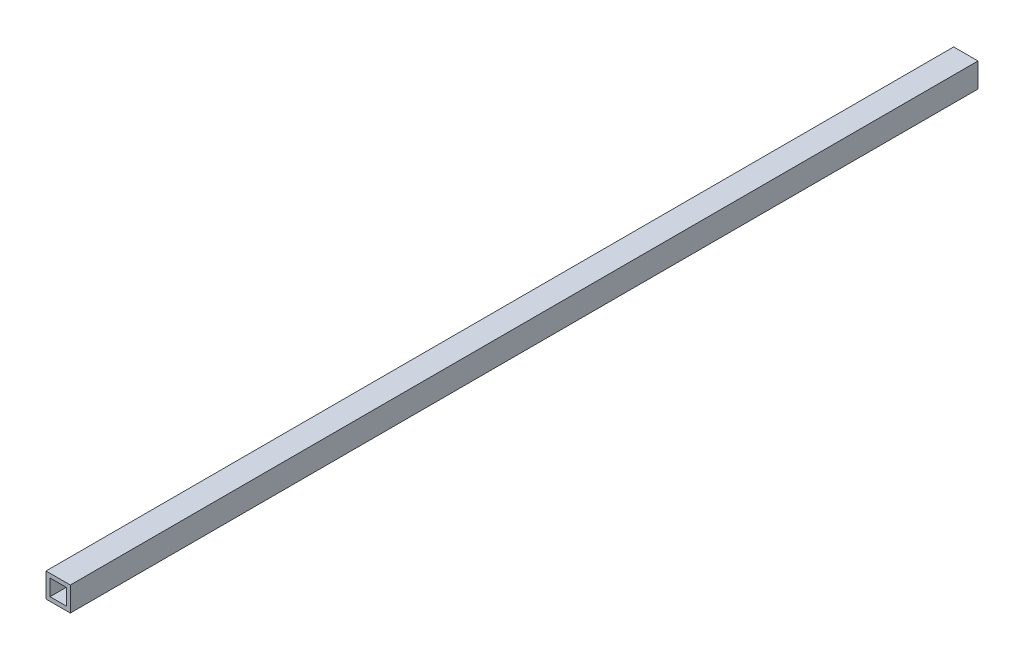
ISO-10303-21;
HEADER;
FILE_DESCRIPTION(('STEP AP214'),'2;1');
FILE_NAME('part.step','',(''),(''),'','','');
FILE_SCHEMA(('AUTOMOTIVE_DESIGN { 1 0 10303 214 1 1 1 1 }'));
ENDSEC;
DATA;
#1=APPLICATION_CONTEXT('core data for automotive mechanical design processes');
#2=APPLICATION_PROTOCOL_DEFINITION('international standard','automotive_design',2000,#1);
#3=PRODUCT_CONTEXT('',#1,'mechanical');
#4=PRODUCT('Part','Part','',(#3));
#5=PRODUCT_RELATED_PRODUCT_CATEGORY('part','',(#4));
#6=PRODUCT_DEFINITION_FORMATION('','',#4);
#7=PRODUCT_DEFINITION_CONTEXT('part definition',#1,'design');
#8=PRODUCT_DEFINITION('design','',#6,#7);
#9=PRODUCT_DEFINITION_SHAPE('','',#8);
#10=(LENGTH_UNIT() NAMED_UNIT(*) SI_UNIT(.MILLI.,.METRE.));
#11=(NAMED_UNIT(*) PLANE_ANGLE_UNIT() SI_UNIT($,.RADIAN.));
#12=(NAMED_UNIT(*) SI_UNIT($,.STERADIAN.) SOLID_ANGLE_UNIT());
#13=UNCERTAINTY_MEASURE_WITH_UNIT(LENGTH_MEASURE(1.E-05),#10,'distance_accuracy_value','');
#14=(GEOMETRIC_REPRESENTATION_CONTEXT(3) GLOBAL_UNCERTAINTY_ASSIGNED_CONTEXT((#13)) GLOBAL_UNIT_ASSIGNED_CONTEXT((#10,
#11,#12)) REPRESENTATION_CONTEXT('',''));
#15=CARTESIAN_POINT('',(0.,0.,0.));
#16=DIRECTION('',(0.,0.,1.));
#17=DIRECTION('',(1.,0.,0.));
#18=AXIS2_PLACEMENT_3D('',#15,#16,#17);
#19=CARTESIAN_POINT('',(9.52500000000001,-9.52499999999999,-711.2));
#20=DIRECTION('',(1.,0.,0.));
#21=DIRECTION('',(0.,0.,-1.));
#22=AXIS2_PLACEMENT_3D('',#19,#20,#21);
#23=PLANE('',#22);
#24=DIRECTION('',(0.,1.,0.));
#25=VECTOR('',#24,1.);
#26=CARTESIAN_POINT('',(9.52500000000001,-9.52499999999999,0.));
#27=LINE('',#26,#25);
#28=CARTESIAN_POINT('',(9.52500000000001,-9.52499999999999,0.));
#29=VERTEX_POINT('',#28);
#30=CARTESIAN_POINT('',(9.52500000000001,9.52500000000001,0.));
#31=VERTEX_POINT('',#30);
#32=EDGE_CURVE('E112',#29,#31,#27,.T.);
#33=ORIENTED_EDGE('',*,*,#32,.F.);
#34=DIRECTION('',(0.,0.,1.));
#35=VECTOR('',#34,1.);
#36=CARTESIAN_POINT('',(9.52500000000001,-9.52499999999999,-711.2));
#37=LINE('',#36,#35);
#38=CARTESIAN_POINT('',(9.52500000000001,-9.52499999999999,-711.2));
#39=VERTEX_POINT('',#38);
#40=EDGE_CURVE('E11',#39,#29,#37,.T.);
#41=ORIENTED_EDGE('',*,*,#40,.F.);
#42=DIRECTION('',(0.,1.,0.));
#43=VECTOR('',#42,1.);
#44=CARTESIAN_POINT('',(9.52500000000001,-9.52499999999999,-711.2));
#45=LINE('',#44,#43);
#46=CARTESIAN_POINT('',(9.52500000000001,9.52500000000001,-711.2));
#47=VERTEX_POINT('',#46);
#48=EDGE_CURVE('E151',#39,#47,#45,.T.);
#49=ORIENTED_EDGE('',*,*,#48,.T.);
#50=DIRECTION('',(0.,0.,1.));
#51=VECTOR('',#50,1.);
#52=CARTESIAN_POINT('',(9.52500000000001,9.52500000000001,-711.2));
#53=LINE('',#52,#51);
#54=EDGE_CURVE('E42',#47,#31,#53,.T.);
#55=ORIENTED_EDGE('',*,*,#54,.T.);
#56=EDGE_LOOP('',(#33,#41,#49,#55));
#57=FACE_BOUND('',#56,.T.);
#58=ADVANCED_FACE('F39',(#57),#23,.T.);
#59=CARTESIAN_POINT('',(-9.525,-9.52499999999999,-711.2));
#60=DIRECTION('',(0.,-1.,0.));
#61=DIRECTION('',(0.,0.,-1.));
#62=AXIS2_PLACEMENT_3D('',#59,#60,#61);
#63=PLANE('',#62);
#64=DIRECTION('',(1.,0.,0.));
#65=VECTOR('',#64,1.);
#66=CARTESIAN_POINT('',(-9.525,-9.52499999999999,0.));
#67=LINE('',#66,#65);
#68=CARTESIAN_POINT('',(-9.525,-9.52499999999999,0.));
#69=VERTEX_POINT('',#68);
#70=EDGE_CURVE('E156',#69,#29,#67,.T.);
#71=ORIENTED_EDGE('',*,*,#70,.F.);
#72=DIRECTION('',(0.,0.,1.));
#73=VECTOR('',#72,1.);
#74=CARTESIAN_POINT('',(-9.525,-9.52499999999999,-711.2));
#75=LINE('',#74,#73);
#76=CARTESIAN_POINT('',(-9.525,-9.52499999999999,-711.2));
#77=VERTEX_POINT('',#76);
#78=EDGE_CURVE('E48',#77,#69,#75,.T.);
#79=ORIENTED_EDGE('',*,*,#78,.F.);
#80=DIRECTION('',(1.,0.,0.));
#81=VECTOR('',#80,1.);
#82=CARTESIAN_POINT('',(-9.525,-9.52499999999999,-711.2));
#83=LINE('',#82,#81);
#84=EDGE_CURVE('E164',#77,#39,#83,.T.);
#85=ORIENTED_EDGE('',*,*,#84,.T.);
#86=ORIENTED_EDGE('',*,*,#40,.T.);
#87=EDGE_LOOP('',(#71,#79,#85,#86));
#88=FACE_BOUND('',#87,.T.);
#89=ADVANCED_FACE('F198',(#88),#63,.T.);
#90=CARTESIAN_POINT('',(-9.525,-9.52499999999999,-711.2));
#91=DIRECTION('',(-1.,0.,0.));
#92=DIRECTION('',(0.,0.,1.));
#93=AXIS2_PLACEMENT_3D('',#90,#91,#92);
#94=PLANE('',#93);
#95=DIRECTION('',(0.,-1.,0.));
#96=VECTOR('',#95,1.);
#97=CARTESIAN_POINT('',(-9.525,-9.52499999999999,0.));
#98=LINE('',#97,#96);
#99=CARTESIAN_POINT('',(-9.525,9.52500000000001,0.));
#100=VERTEX_POINT('',#99);
#101=EDGE_CURVE('E175',#100,#69,#98,.T.);
#102=ORIENTED_EDGE('',*,*,#101,.F.);
#103=DIRECTION('',(0.,0.,1.));
#104=VECTOR('',#103,1.);
#105=CARTESIAN_POINT('',(-9.525,9.52500000000001,-711.2));
#106=LINE('',#105,#104);
#107=CARTESIAN_POINT('',(-9.525,9.52500000000001,-711.2));
#108=VERTEX_POINT('',#107);
#109=EDGE_CURVE('E183',#108,#100,#106,.T.);
#110=ORIENTED_EDGE('',*,*,#109,.F.);
#111=DIRECTION('',(0.,-1.,0.));
#112=VECTOR('',#111,1.);
#113=CARTESIAN_POINT('',(-9.525,-9.52499999999999,-711.2));
#114=LINE('',#113,#112);
#115=EDGE_CURVE('E160',#108,#77,#114,.T.);
#116=ORIENTED_EDGE('',*,*,#115,.T.);
#117=ORIENTED_EDGE('',*,*,#78,.T.);
#118=EDGE_LOOP('',(#102,#110,#116,#117));
#119=FACE_BOUND('',#118,.T.);
#120=ADVANCED_FACE('F202',(#119),#94,.T.);
#121=CARTESIAN_POINT('',(-9.525,9.52500000000001,-711.2));
#122=DIRECTION('',(0.,1.,0.));
#123=DIRECTION('',(0.,0.,1.));
#124=AXIS2_PLACEMENT_3D('',#121,#122,#123);
#125=PLANE('',#124);
#126=DIRECTION('',(-1.,0.,0.));
#127=VECTOR('',#126,1.);
#128=CARTESIAN_POINT('',(-9.525,9.52500000000001,0.));
#129=LINE('',#128,#127);
#130=EDGE_CURVE('E171',#31,#100,#129,.T.);
#131=ORIENTED_EDGE('',*,*,#130,.F.);
#132=ORIENTED_EDGE('',*,*,#54,.F.);
#133=DIRECTION('',(-1.,0.,0.));
#134=VECTOR('',#133,1.);
#135=CARTESIAN_POINT('',(-9.525,9.52500000000001,-711.2));
#136=LINE('',#135,#134);
#137=EDGE_CURVE('E155',#47,#108,#136,.T.);
#138=ORIENTED_EDGE('',*,*,#137,.T.);
#139=ORIENTED_EDGE('',*,*,#109,.T.);
#140=EDGE_LOOP('',(#131,#132,#138,#139));
#141=FACE_BOUND('',#140,.T.);
#142=ADVANCED_FACE('F193',(#141),#125,.T.);
#143=CARTESIAN_POINT('',(0.,0.,-711.2));
#144=DIRECTION('',(0.,0.,-1.));
#145=DIRECTION('',(-1.,0.,0.));
#146=AXIS2_PLACEMENT_3D('',#143,#144,#145);
#147=PLANE('',#146);
#148=DIRECTION('',(0.,1.,0.));
#149=VECTOR('',#148,1.);
#150=CARTESIAN_POINT('',(6.35,-6.35,-711.2));
#151=LINE('',#150,#149);
#152=CARTESIAN_POINT('',(6.35,-6.35,-711.2));
#153=VERTEX_POINT('',#152);
#154=CARTESIAN_POINT('',(6.35,6.35,-711.2));
#155=VERTEX_POINT('',#154);
#156=EDGE_CURVE('E116',#153,#155,#151,.T.);
#157=ORIENTED_EDGE('',*,*,#156,.T.);
#158=DIRECTION('',(-1.,0.,0.));
#159=VECTOR('',#158,1.);
#160=CARTESIAN_POINT('',(-6.35,6.35,-711.2));
#161=LINE('',#160,#159);
#162=CARTESIAN_POINT('',(-6.35,6.35,-711.2));
#163=VERTEX_POINT('',#162);
#164=EDGE_CURVE('E104',#155,#163,#161,.T.);
#165=ORIENTED_EDGE('',*,*,#164,.T.);
#166=DIRECTION('',(0.,-1.,0.));
#167=VECTOR('',#166,1.);
#168=CARTESIAN_POINT('',(-6.35,-6.35,-711.2));
#169=LINE('',#168,#167);
#170=CARTESIAN_POINT('',(-6.35,-6.35,-711.2));
#171=VERTEX_POINT('',#170);
#172=EDGE_CURVE('E131',#163,#171,#169,.T.);
#173=ORIENTED_EDGE('',*,*,#172,.T.);
#174=DIRECTION('',(1.,0.,0.));
#175=VECTOR('',#174,1.);
#176=CARTESIAN_POINT('',(-6.35,-6.35,-711.2));
#177=LINE('',#176,#175);
#178=EDGE_CURVE('E124',#171,#153,#177,.T.);
#179=ORIENTED_EDGE('',*,*,#178,.T.);
#180=EDGE_LOOP('',(#157,#165,#173,#179));
#181=FACE_BOUND('',#180,.T.);
#182=ORIENTED_EDGE('',*,*,#48,.F.);
#183=ORIENTED_EDGE('',*,*,#84,.F.);
#184=ORIENTED_EDGE('',*,*,#115,.F.);
#185=ORIENTED_EDGE('',*,*,#137,.F.);
#186=EDGE_LOOP('',(#182,#183,#184,#185));
#187=FACE_BOUND('',#186,.T.);
#188=ADVANCED_FACE('F122',(#181,#187),#147,.T.);
#189=CARTESIAN_POINT('',(0.,0.,0.));
#190=DIRECTION('',(0.,0.,-1.));
#191=DIRECTION('',(-1.,0.,0.));
#192=AXIS2_PLACEMENT_3D('',#189,#190,#191);
#193=PLANE('',#192);
#194=DIRECTION('',(-1.,0.,0.));
#195=VECTOR('',#194,1.);
#196=CARTESIAN_POINT('',(-6.35,6.35,0.));
#197=LINE('',#196,#195);
#198=CARTESIAN_POINT('',(6.35,6.35,0.));
#199=VERTEX_POINT('',#198);
#200=CARTESIAN_POINT('',(-6.35,6.35,0.));
#201=VERTEX_POINT('',#200);
#202=EDGE_CURVE('E129',#199,#201,#197,.T.);
#203=ORIENTED_EDGE('',*,*,#202,.F.);
#204=DIRECTION('',(0.,1.,0.));
#205=VECTOR('',#204,1.);
#206=CARTESIAN_POINT('',(6.35,-6.35,0.));
#207=LINE('',#206,#205);
#208=CARTESIAN_POINT('',(6.35,-6.35,0.));
#209=VERTEX_POINT('',#208);
#210=EDGE_CURVE('E64',#209,#199,#207,.T.);
#211=ORIENTED_EDGE('',*,*,#210,.F.);
#212=DIRECTION('',(1.,0.,0.));
#213=VECTOR('',#212,1.);
#214=CARTESIAN_POINT('',(-6.35,-6.35,0.));
#215=LINE('',#214,#213);
#216=CARTESIAN_POINT('',(-6.35,-6.35,0.));
#217=VERTEX_POINT('',#216);
#218=EDGE_CURVE('E119',#217,#209,#215,.T.);
#219=ORIENTED_EDGE('',*,*,#218,.F.);
#220=DIRECTION('',(0.,-1.,0.));
#221=VECTOR('',#220,1.);
#222=CARTESIAN_POINT('',(-6.35,-6.35,0.));
#223=LINE('',#222,#221);
#224=EDGE_CURVE('E137',#201,#217,#223,.T.);
#225=ORIENTED_EDGE('',*,*,#224,.F.);
#226=EDGE_LOOP('',(#203,#211,#219,#225));
#227=FACE_BOUND('',#226,.T.);
#228=ORIENTED_EDGE('',*,*,#32,.T.);
#229=ORIENTED_EDGE('',*,*,#130,.T.);
#230=ORIENTED_EDGE('',*,*,#101,.T.);
#231=ORIENTED_EDGE('',*,*,#70,.T.);
#232=EDGE_LOOP('',(#228,#229,#230,#231));
#233=FACE_BOUND('',#232,.T.);
#234=ADVANCED_FACE('F195',(#227,#233),#193,.F.);
#235=CARTESIAN_POINT('',(6.35,-6.35,-711.201));
#236=DIRECTION('',(1.,0.,0.));
#237=DIRECTION('',(0.,0.,-1.));
#238=AXIS2_PLACEMENT_3D('',#235,#236,#237);
#239=PLANE('',#238);
#240=DIRECTION('',(0.,0.,1.));
#241=VECTOR('',#240,1.);
#242=CARTESIAN_POINT('',(6.35,-6.35,-711.201));
#243=LINE('',#242,#241);
#244=EDGE_CURVE('E113',#153,#209,#243,.T.);
#245=ORIENTED_EDGE('',*,*,#244,.T.);
#246=ORIENTED_EDGE('',*,*,#210,.T.);
#247=DIRECTION('',(0.,0.,1.));
#248=VECTOR('',#247,1.);
#249=CARTESIAN_POINT('',(6.35,6.35,-711.201));
#250=LINE('',#249,#248);
#251=EDGE_CURVE('E106',#155,#199,#250,.T.);
#252=ORIENTED_EDGE('',*,*,#251,.F.);
#253=ORIENTED_EDGE('',*,*,#156,.F.);
#254=EDGE_LOOP('',(#245,#246,#252,#253));
#255=FACE_BOUND('',#254,.T.);
#256=ADVANCED_FACE('F115',(#255),#239,.F.);
#257=CARTESIAN_POINT('',(-6.35,-6.35,-711.201));
#258=DIRECTION('',(0.,-1.,0.));
#259=DIRECTION('',(0.,0.,-1.));
#260=AXIS2_PLACEMENT_3D('',#257,#258,#259);
#261=PLANE('',#260);
#262=DIRECTION('',(0.,0.,1.));
#263=VECTOR('',#262,1.);
#264=CARTESIAN_POINT('',(-6.35,-6.35,-711.201));
#265=LINE('',#264,#263);
#266=EDGE_CURVE('E146',#171,#217,#265,.T.);
#267=ORIENTED_EDGE('',*,*,#266,.T.);
#268=ORIENTED_EDGE('',*,*,#218,.T.);
#269=ORIENTED_EDGE('',*,*,#244,.F.);
#270=ORIENTED_EDGE('',*,*,#178,.F.);
#271=EDGE_LOOP('',(#267,#268,#269,#270));
#272=FACE_BOUND('',#271,.T.);
#273=ADVANCED_FACE('F253',(#272),#261,.F.);
#274=CARTESIAN_POINT('',(-6.35,-6.35,-711.201));
#275=DIRECTION('',(-1.,0.,0.));
#276=DIRECTION('',(0.,0.,1.));
#277=AXIS2_PLACEMENT_3D('',#274,#275,#276);
#278=PLANE('',#277);
#279=DIRECTION('',(0.,0.,1.));
#280=VECTOR('',#279,1.);
#281=CARTESIAN_POINT('',(-6.35,6.35,-711.201));
#282=LINE('',#281,#280);
#283=EDGE_CURVE('E56',#163,#201,#282,.T.);
#284=ORIENTED_EDGE('',*,*,#283,.T.);
#285=ORIENTED_EDGE('',*,*,#224,.T.);
#286=ORIENTED_EDGE('',*,*,#266,.F.);
#287=ORIENTED_EDGE('',*,*,#172,.F.);
#288=EDGE_LOOP('',(#284,#285,#286,#287));
#289=FACE_BOUND('',#288,.T.);
#290=ADVANCED_FACE('F262',(#289),#278,.F.);
#291=CARTESIAN_POINT('',(-6.35,6.35,-711.201));
#292=DIRECTION('',(0.,1.,0.));
#293=DIRECTION('',(0.,0.,1.));
#294=AXIS2_PLACEMENT_3D('',#291,#292,#293);
#295=PLANE('',#294);
#296=ORIENTED_EDGE('',*,*,#251,.T.);
#297=ORIENTED_EDGE('',*,*,#202,.T.);
#298=ORIENTED_EDGE('',*,*,#283,.F.);
#299=ORIENTED_EDGE('',*,*,#164,.F.);
#300=EDGE_LOOP('',(#296,#297,#298,#299));
#301=FACE_BOUND('',#300,.T.);
#302=ADVANCED_FACE('F105',(#301),#295,.F.);
#303=CLOSED_SHELL('',(#58,#89,#120,#142,#188,#234,#256,#273,#290,#302));
#304=MANIFOLD_SOLID_BREP('B2',#303);
#305=ADVANCED_BREP_SHAPE_REPRESENTATION('',(#18,#304),#14);
#306=SHAPE_DEFINITION_REPRESENTATION(#9,#305);
ENDSEC;
END-ISO-10303-21;
